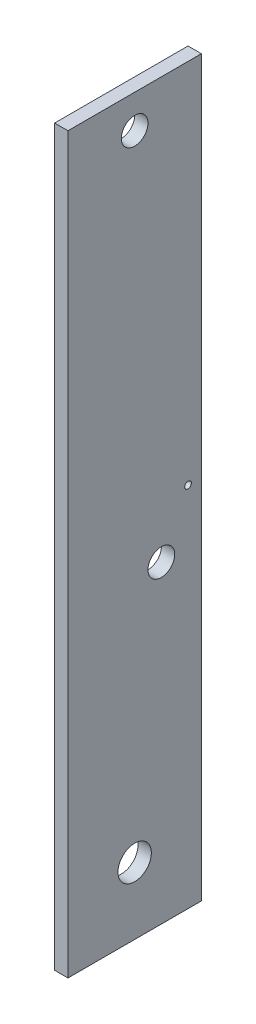
ISO-10303-21;
HEADER;
FILE_DESCRIPTION(('STEP AP214'),'2;1');
FILE_NAME('part.step','',(''),(''),'','','');
FILE_SCHEMA(('AUTOMOTIVE_DESIGN { 1 0 10303 214 1 1 1 1 }'));
ENDSEC;
DATA;
#1=APPLICATION_CONTEXT('core data for automotive mechanical design processes');
#2=APPLICATION_PROTOCOL_DEFINITION('international standard','automotive_design',2000,#1);
#3=PRODUCT_CONTEXT('',#1,'mechanical');
#4=PRODUCT('Part','Part','',(#3));
#5=PRODUCT_RELATED_PRODUCT_CATEGORY('part','',(#4));
#6=PRODUCT_DEFINITION_FORMATION('','',#4);
#7=PRODUCT_DEFINITION_CONTEXT('part definition',#1,'design');
#8=PRODUCT_DEFINITION('design','',#6,#7);
#9=PRODUCT_DEFINITION_SHAPE('','',#8);
#10=(LENGTH_UNIT() NAMED_UNIT(*) SI_UNIT(.MILLI.,.METRE.));
#11=(NAMED_UNIT(*) PLANE_ANGLE_UNIT() SI_UNIT($,.RADIAN.));
#12=(NAMED_UNIT(*) SI_UNIT($,.STERADIAN.) SOLID_ANGLE_UNIT());
#13=UNCERTAINTY_MEASURE_WITH_UNIT(LENGTH_MEASURE(1.E-05),#10,'distance_accuracy_value','');
#14=(GEOMETRIC_REPRESENTATION_CONTEXT(3) GLOBAL_UNCERTAINTY_ASSIGNED_CONTEXT((#13)) GLOBAL_UNIT_ASSIGNED_CONTEXT((#10,
#11,#12)) REPRESENTATION_CONTEXT('',''));
#15=CARTESIAN_POINT('',(0.,0.,0.));
#16=DIRECTION('',(0.,0.,1.));
#17=DIRECTION('',(1.,0.,0.));
#18=AXIS2_PLACEMENT_3D('',#15,#16,#17);
#19=CARTESIAN_POINT('',(2.,0.,0.));
#20=DIRECTION('',(0.,0.,-1.));
#21=DIRECTION('',(-1.,0.,0.));
#22=AXIS2_PLACEMENT_3D('',#19,#20,#21);
#23=PLANE('',#22);
#24=DIRECTION('',(0.,-1.,0.));
#25=VECTOR('',#24,1.);
#26=CARTESIAN_POINT('',(0.,0.,0.));
#27=LINE('',#26,#25);
#28=CARTESIAN_POINT('',(0.,110.,0.));
#29=VERTEX_POINT('',#28);
#30=CARTESIAN_POINT('',(0.,0.,0.));
#31=VERTEX_POINT('',#30);
#32=EDGE_CURVE('E96',#29,#31,#27,.T.);
#33=ORIENTED_EDGE('',*,*,#32,.T.);
#34=DIRECTION('',(-1.,0.,0.));
#35=VECTOR('',#34,1.);
#36=CARTESIAN_POINT('',(2.,0.,0.));
#37=LINE('',#36,#35);
#38=CARTESIAN_POINT('',(2.,0.,0.));
#39=VERTEX_POINT('',#38);
#40=EDGE_CURVE('E11',#39,#31,#37,.T.);
#41=ORIENTED_EDGE('',*,*,#40,.F.);
#42=DIRECTION('',(0.,-1.,0.));
#43=VECTOR('',#42,1.);
#44=CARTESIAN_POINT('',(2.,0.,0.));
#45=LINE('',#44,#43);
#46=CARTESIAN_POINT('',(2.,110.,0.));
#47=VERTEX_POINT('',#46);
#48=EDGE_CURVE('E84',#47,#39,#45,.T.);
#49=ORIENTED_EDGE('',*,*,#48,.F.);
#50=DIRECTION('',(-1.,0.,0.));
#51=VECTOR('',#50,1.);
#52=CARTESIAN_POINT('',(2.,110.,0.));
#53=LINE('',#52,#51);
#54=EDGE_CURVE('E92',#47,#29,#53,.T.);
#55=ORIENTED_EDGE('',*,*,#54,.T.);
#56=EDGE_LOOP('',(#33,#41,#49,#55));
#57=FACE_BOUND('',#56,.T.);
#58=ADVANCED_FACE('F33',(#57),#23,.F.);
#59=CARTESIAN_POINT('',(2.,0.,0.));
#60=DIRECTION('',(0.,1.,0.));
#61=DIRECTION('',(0.,0.,1.));
#62=AXIS2_PLACEMENT_3D('',#59,#60,#61);
#63=PLANE('',#62);
#64=DIRECTION('',(0.,0.,-1.));
#65=VECTOR('',#64,1.);
#66=CARTESIAN_POINT('',(0.,0.,0.));
#67=LINE('',#66,#65);
#68=CARTESIAN_POINT('',(0.,0.,-20.));
#69=VERTEX_POINT('',#68);
#70=EDGE_CURVE('E88',#31,#69,#67,.T.);
#71=ORIENTED_EDGE('',*,*,#70,.T.);
#72=DIRECTION('',(-1.,0.,0.));
#73=VECTOR('',#72,1.);
#74=CARTESIAN_POINT('',(2.,0.,-20.));
#75=LINE('',#74,#73);
#76=CARTESIAN_POINT('',(2.,0.,-20.));
#77=VERTEX_POINT('',#76);
#78=EDGE_CURVE('E41',#77,#69,#75,.T.);
#79=ORIENTED_EDGE('',*,*,#78,.F.);
#80=DIRECTION('',(0.,0.,-1.));
#81=VECTOR('',#80,1.);
#82=CARTESIAN_POINT('',(2.,0.,0.));
#83=LINE('',#82,#81);
#84=EDGE_CURVE('E79',#39,#77,#83,.T.);
#85=ORIENTED_EDGE('',*,*,#84,.F.);
#86=ORIENTED_EDGE('',*,*,#40,.T.);
#87=EDGE_LOOP('',(#71,#79,#85,#86));
#88=FACE_BOUND('',#87,.T.);
#89=ADVANCED_FACE('F87',(#88),#63,.F.);
#90=CARTESIAN_POINT('',(2.,0.,-20.));
#91=DIRECTION('',(0.,0.,1.));
#92=DIRECTION('',(1.,0.,0.));
#93=AXIS2_PLACEMENT_3D('',#90,#91,#92);
#94=PLANE('',#93);
#95=DIRECTION('',(0.,1.,0.));
#96=VECTOR('',#95,1.);
#97=CARTESIAN_POINT('',(0.,0.,-20.));
#98=LINE('',#97,#96);
#99=CARTESIAN_POINT('',(0.,110.,-20.));
#100=VERTEX_POINT('',#99);
#101=EDGE_CURVE('E66',#69,#100,#98,.T.);
#102=ORIENTED_EDGE('',*,*,#101,.T.);
#103=DIRECTION('',(-1.,0.,0.));
#104=VECTOR('',#103,1.);
#105=CARTESIAN_POINT('',(2.,110.,-20.));
#106=LINE('',#105,#104);
#107=CARTESIAN_POINT('',(2.,110.,-20.));
#108=VERTEX_POINT('',#107);
#109=EDGE_CURVE('E89',#108,#100,#106,.T.);
#110=ORIENTED_EDGE('',*,*,#109,.F.);
#111=DIRECTION('',(0.,1.,0.));
#112=VECTOR('',#111,1.);
#113=CARTESIAN_POINT('',(2.,0.,-20.));
#114=LINE('',#113,#112);
#115=EDGE_CURVE('E82',#77,#108,#114,.T.);
#116=ORIENTED_EDGE('',*,*,#115,.F.);
#117=ORIENTED_EDGE('',*,*,#78,.T.);
#118=EDGE_LOOP('',(#102,#110,#116,#117));
#119=FACE_BOUND('',#118,.T.);
#120=ADVANCED_FACE('F90',(#119),#94,.F.);
#121=CARTESIAN_POINT('',(2.,110.,0.));
#122=DIRECTION('',(0.,-1.,0.));
#123=DIRECTION('',(0.,0.,-1.));
#124=AXIS2_PLACEMENT_3D('',#121,#122,#123);
#125=PLANE('',#124);
#126=DIRECTION('',(0.,0.,1.));
#127=VECTOR('',#126,1.);
#128=CARTESIAN_POINT('',(0.,110.,0.));
#129=LINE('',#128,#127);
#130=EDGE_CURVE('E72',#100,#29,#129,.T.);
#131=ORIENTED_EDGE('',*,*,#130,.T.);
#132=ORIENTED_EDGE('',*,*,#54,.F.);
#133=DIRECTION('',(0.,0.,1.));
#134=VECTOR('',#133,1.);
#135=CARTESIAN_POINT('',(2.,110.,0.));
#136=LINE('',#135,#134);
#137=EDGE_CURVE('E49',#108,#47,#136,.T.);
#138=ORIENTED_EDGE('',*,*,#137,.F.);
#139=ORIENTED_EDGE('',*,*,#109,.T.);
#140=EDGE_LOOP('',(#131,#132,#138,#139));
#141=FACE_BOUND('',#140,.T.);
#142=ADVANCED_FACE('F104',(#141),#125,.F.);
#143=CARTESIAN_POINT('',(2.,0.,0.));
#144=DIRECTION('',(-1.,0.,0.));
#145=DIRECTION('',(0.,0.,1.));
#146=AXIS2_PLACEMENT_3D('',#143,#144,#145);
#147=PLANE('',#146);
#148=CARTESIAN_POINT('',(2.,105.,-10.));
#149=DIRECTION('',(1.,0.,0.));
#150=DIRECTION('',(0.,0.,-1.));
#151=AXIS2_PLACEMENT_3D('',#148,#149,#150);
#152=CIRCLE('',#151,2.);
#153=CARTESIAN_POINT('',(2.,105.,-12.));
#154=VERTEX_POINT('',#153);
#155=EDGE_CURVE('E128',#154,#154,#152,.T.);
#156=ORIENTED_EDGE('',*,*,#155,.F.);
#157=EDGE_LOOP('',(#156));
#158=FACE_BOUND('',#157,.T.);
#159=CARTESIAN_POINT('',(2.,47.,-14.));
#160=DIRECTION('',(1.,0.,0.));
#161=DIRECTION('',(0.,0.,-1.));
#162=AXIS2_PLACEMENT_3D('',#159,#160,#161);
#163=CIRCLE('',#162,2.00000000000001);
#164=CARTESIAN_POINT('',(2.,47.,-16.));
#165=VERTEX_POINT('',#164);
#166=EDGE_CURVE('E122',#165,#165,#163,.T.);
#167=ORIENTED_EDGE('',*,*,#166,.F.);
#168=EDGE_LOOP('',(#167));
#169=FACE_BOUND('',#168,.T.);
#170=CARTESIAN_POINT('',(2.,55.,-18.));
#171=DIRECTION('',(1.,0.,0.));
#172=DIRECTION('',(0.,0.,-1.));
#173=AXIS2_PLACEMENT_3D('',#170,#171,#172);
#174=CIRCLE('',#173,0.499999999999999);
#175=CARTESIAN_POINT('',(2.,55.,-18.5));
#176=VERTEX_POINT('',#175);
#177=EDGE_CURVE('E116',#176,#176,#174,.T.);
#178=ORIENTED_EDGE('',*,*,#177,.F.);
#179=EDGE_LOOP('',(#178));
#180=FACE_BOUND('',#179,.T.);
#181=CARTESIAN_POINT('',(2.,10.,-10.));
#182=DIRECTION('',(1.,0.,0.));
#183=DIRECTION('',(0.,0.,-1.));
#184=AXIS2_PLACEMENT_3D('',#181,#182,#183);
#185=CIRCLE('',#184,2.5);
#186=CARTESIAN_POINT('',(2.,10.,-12.5));
#187=VERTEX_POINT('',#186);
#188=EDGE_CURVE('E110',#187,#187,#185,.T.);
#189=ORIENTED_EDGE('',*,*,#188,.F.);
#190=EDGE_LOOP('',(#189));
#191=FACE_BOUND('',#190,.T.);
#192=ORIENTED_EDGE('',*,*,#48,.T.);
#193=ORIENTED_EDGE('',*,*,#84,.T.);
#194=ORIENTED_EDGE('',*,*,#115,.T.);
#195=ORIENTED_EDGE('',*,*,#137,.T.);
#196=EDGE_LOOP('',(#192,#193,#194,#195));
#197=FACE_BOUND('',#196,.T.);
#198=ADVANCED_FACE('F80',(#158,#169,#180,#191,#197),#147,.F.);
#199=CARTESIAN_POINT('',(0.,0.,0.));
#200=DIRECTION('',(-1.,0.,0.));
#201=DIRECTION('',(0.,0.,1.));
#202=AXIS2_PLACEMENT_3D('',#199,#200,#201);
#203=PLANE('',#202);
#204=CARTESIAN_POINT('',(0.,105.,-10.));
#205=DIRECTION('',(1.,0.,0.));
#206=DIRECTION('',(0.,0.,-1.));
#207=AXIS2_PLACEMENT_3D('',#204,#205,#206);
#208=CIRCLE('',#207,2.);
#209=CARTESIAN_POINT('',(0.,105.,-12.));
#210=VERTEX_POINT('',#209);
#211=EDGE_CURVE('E113',#210,#210,#208,.T.);
#212=ORIENTED_EDGE('',*,*,#211,.T.);
#213=EDGE_LOOP('',(#212));
#214=FACE_BOUND('',#213,.T.);
#215=CARTESIAN_POINT('',(0.,47.,-14.));
#216=DIRECTION('',(1.,0.,0.));
#217=DIRECTION('',(0.,0.,-1.));
#218=AXIS2_PLACEMENT_3D('',#215,#216,#217);
#219=CIRCLE('',#218,2.00000000000001);
#220=CARTESIAN_POINT('',(0.,47.,-16.));
#221=VERTEX_POINT('',#220);
#222=EDGE_CURVE('E125',#221,#221,#219,.T.);
#223=ORIENTED_EDGE('',*,*,#222,.T.);
#224=EDGE_LOOP('',(#223));
#225=FACE_BOUND('',#224,.T.);
#226=CARTESIAN_POINT('',(0.,55.,-18.));
#227=DIRECTION('',(1.,0.,0.));
#228=DIRECTION('',(0.,0.,-1.));
#229=AXIS2_PLACEMENT_3D('',#226,#227,#228);
#230=CIRCLE('',#229,0.499999999999999);
#231=CARTESIAN_POINT('',(0.,55.,-18.5));
#232=VERTEX_POINT('',#231);
#233=EDGE_CURVE('E119',#232,#232,#230,.T.);
#234=ORIENTED_EDGE('',*,*,#233,.T.);
#235=EDGE_LOOP('',(#234));
#236=FACE_BOUND('',#235,.T.);
#237=CARTESIAN_POINT('',(0.,10.,-10.));
#238=DIRECTION('',(1.,0.,0.));
#239=DIRECTION('',(0.,0.,-1.));
#240=AXIS2_PLACEMENT_3D('',#237,#238,#239);
#241=CIRCLE('',#240,2.5);
#242=CARTESIAN_POINT('',(0.,10.,-12.5));
#243=VERTEX_POINT('',#242);
#244=EDGE_CURVE('E99',#243,#243,#241,.T.);
#245=ORIENTED_EDGE('',*,*,#244,.T.);
#246=EDGE_LOOP('',(#245));
#247=FACE_BOUND('',#246,.T.);
#248=ORIENTED_EDGE('',*,*,#32,.F.);
#249=ORIENTED_EDGE('',*,*,#130,.F.);
#250=ORIENTED_EDGE('',*,*,#101,.F.);
#251=ORIENTED_EDGE('',*,*,#70,.F.);
#252=EDGE_LOOP('',(#248,#249,#250,#251));
#253=FACE_BOUND('',#252,.T.);
#254=ADVANCED_FACE('F107',(#214,#225,#236,#247,#253),#203,.T.);
#255=CARTESIAN_POINT('',(0.,10.,-10.));
#256=DIRECTION('',(1.,0.,0.));
#257=DIRECTION('',(0.,0.,-1.));
#258=AXIS2_PLACEMENT_3D('',#255,#256,#257);
#259=CYLINDRICAL_SURFACE('',#258,2.5);
#260=ORIENTED_EDGE('',*,*,#244,.F.);
#261=EDGE_LOOP('',(#260));
#262=FACE_BOUND('',#261,.T.);
#263=ORIENTED_EDGE('',*,*,#188,.T.);
#264=EDGE_LOOP('',(#263));
#265=FACE_BOUND('',#264,.T.);
#266=ADVANCED_FACE('F152',(#262,#265),#259,.F.);
#267=CARTESIAN_POINT('',(0.,55.,-18.));
#268=DIRECTION('',(1.,0.,0.));
#269=DIRECTION('',(0.,0.,-1.));
#270=AXIS2_PLACEMENT_3D('',#267,#268,#269);
#271=CYLINDRICAL_SURFACE('',#270,0.499999999999999);
#272=ORIENTED_EDGE('',*,*,#233,.F.);
#273=EDGE_LOOP('',(#272));
#274=FACE_BOUND('',#273,.T.);
#275=ORIENTED_EDGE('',*,*,#177,.T.);
#276=EDGE_LOOP('',(#275));
#277=FACE_BOUND('',#276,.T.);
#278=ADVANCED_FACE('F154',(#274,#277),#271,.F.);
#279=CARTESIAN_POINT('',(0.,47.,-14.));
#280=DIRECTION('',(1.,0.,0.));
#281=DIRECTION('',(0.,0.,-1.));
#282=AXIS2_PLACEMENT_3D('',#279,#280,#281);
#283=CYLINDRICAL_SURFACE('',#282,2.00000000000001);
#284=ORIENTED_EDGE('',*,*,#222,.F.);
#285=EDGE_LOOP('',(#284));
#286=FACE_BOUND('',#285,.T.);
#287=ORIENTED_EDGE('',*,*,#166,.T.);
#288=EDGE_LOOP('',(#287));
#289=FACE_BOUND('',#288,.T.);
#290=ADVANCED_FACE('F139',(#286,#289),#283,.F.);
#291=CARTESIAN_POINT('',(0.,105.,-10.));
#292=DIRECTION('',(1.,0.,0.));
#293=DIRECTION('',(0.,0.,-1.));
#294=AXIS2_PLACEMENT_3D('',#291,#292,#293);
#295=CYLINDRICAL_SURFACE('',#294,2.);
#296=ORIENTED_EDGE('',*,*,#211,.F.);
#297=EDGE_LOOP('',(#296));
#298=FACE_BOUND('',#297,.T.);
#299=ORIENTED_EDGE('',*,*,#155,.T.);
#300=EDGE_LOOP('',(#299));
#301=FACE_BOUND('',#300,.T.);
#302=ADVANCED_FACE('F136',(#298,#301),#295,.F.);
#303=CLOSED_SHELL('',(#58,#89,#120,#142,#198,#254,#266,#278,#290,#302));
#304=MANIFOLD_SOLID_BREP('B2',#303);
#305=ADVANCED_BREP_SHAPE_REPRESENTATION('',(#18,#304),#14);
#306=SHAPE_DEFINITION_REPRESENTATION(#9,#305);
ENDSEC;
END-ISO-10303-21;
